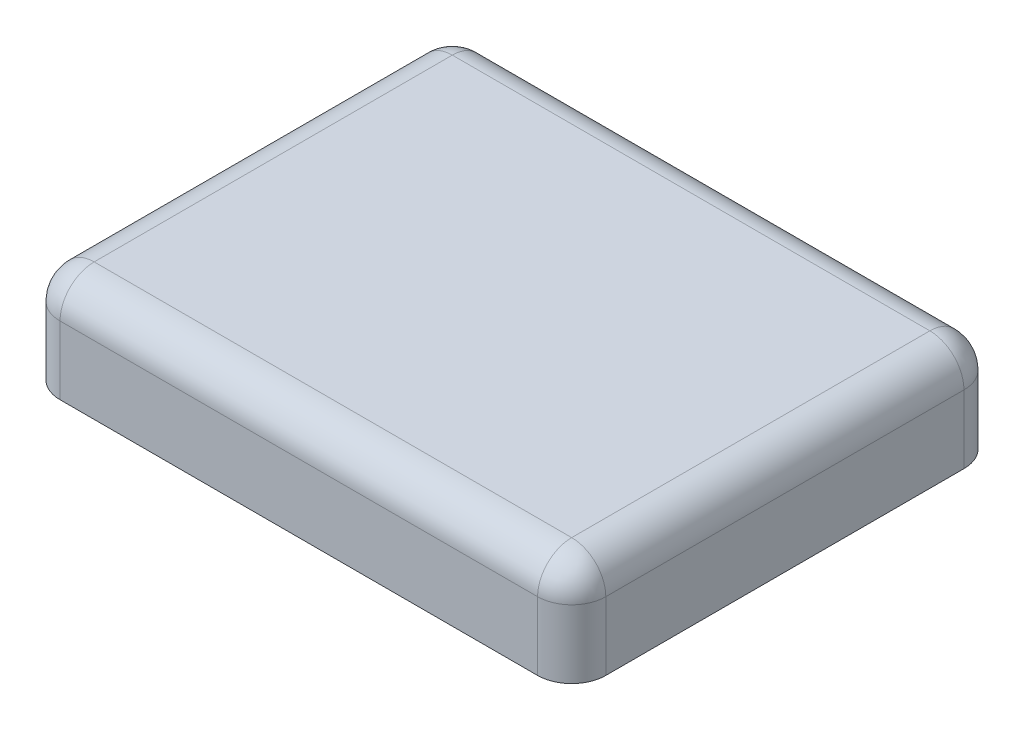
ISO-10303-21;
HEADER;
FILE_DESCRIPTION(('STEP AP214'),'2;1');
FILE_NAME('part.step','',(''),(''),'','','');
FILE_SCHEMA(('AUTOMOTIVE_DESIGN { 1 0 10303 214 1 1 1 1 }'));
ENDSEC;
DATA;
#1=APPLICATION_CONTEXT('core data for automotive mechanical design processes');
#2=APPLICATION_PROTOCOL_DEFINITION('international standard','automotive_design',2000,#1);
#3=PRODUCT_CONTEXT('',#1,'mechanical');
#4=PRODUCT('Part','Part','',(#3));
#5=PRODUCT_RELATED_PRODUCT_CATEGORY('part','',(#4));
#6=PRODUCT_DEFINITION_FORMATION('','',#4);
#7=PRODUCT_DEFINITION_CONTEXT('part definition',#1,'design');
#8=PRODUCT_DEFINITION('design','',#6,#7);
#9=PRODUCT_DEFINITION_SHAPE('','',#8);
#10=(LENGTH_UNIT() NAMED_UNIT(*) SI_UNIT(.MILLI.,.METRE.));
#11=(NAMED_UNIT(*) PLANE_ANGLE_UNIT() SI_UNIT($,.RADIAN.));
#12=(NAMED_UNIT(*) SI_UNIT($,.STERADIAN.) SOLID_ANGLE_UNIT());
#13=UNCERTAINTY_MEASURE_WITH_UNIT(LENGTH_MEASURE(1.E-05),#10,'distance_accuracy_value','');
#14=(GEOMETRIC_REPRESENTATION_CONTEXT(3) GLOBAL_UNCERTAINTY_ASSIGNED_CONTEXT((#13)) GLOBAL_UNIT_ASSIGNED_CONTEXT((#10,
#11,#12)) REPRESENTATION_CONTEXT('',''));
#15=CARTESIAN_POINT('',(0.,0.,0.));
#16=DIRECTION('',(0.,0.,1.));
#17=DIRECTION('',(1.,0.,0.));
#18=AXIS2_PLACEMENT_3D('',#15,#16,#17);
#19=CARTESIAN_POINT('',(1.6,0.6,-1.25));
#20=DIRECTION('',(-1.,0.,0.));
#21=DIRECTION('',(0.,0.,1.));
#22=AXIS2_PLACEMENT_3D('',#19,#20,#21);
#23=PLANE('',#22);
#24=DIRECTION('',(0.,-1.,0.));
#25=VECTOR('',#24,1.);
#26=CARTESIAN_POINT('',(1.6,0.6,-1.05));
#27=LINE('',#26,#25);
#28=CARTESIAN_POINT('',(1.6,0.,-1.05));
#29=VERTEX_POINT('',#28);
#30=CARTESIAN_POINT('',(1.6,0.4,-1.05));
#31=VERTEX_POINT('',#30);
#32=EDGE_CURVE('E121',#29,#31,#27,.F.);
#33=ORIENTED_EDGE('',*,*,#32,.T.);
#34=DIRECTION('',(0.,0.,-1.));
#35=VECTOR('',#34,1.);
#36=CARTESIAN_POINT('',(1.6,0.4,1.05));
#37=LINE('',#36,#35);
#38=CARTESIAN_POINT('',(1.6,0.4,1.05));
#39=VERTEX_POINT('',#38);
#40=EDGE_CURVE('E61',#31,#39,#37,.F.);
#41=ORIENTED_EDGE('',*,*,#40,.T.);
#42=DIRECTION('',(0.,-1.,0.));
#43=VECTOR('',#42,1.);
#44=CARTESIAN_POINT('',(1.6,0.6,1.05));
#45=LINE('',#44,#43);
#46=CARTESIAN_POINT('',(1.6,0.,1.05));
#47=VERTEX_POINT('',#46);
#48=EDGE_CURVE('E114',#39,#47,#45,.T.);
#49=ORIENTED_EDGE('',*,*,#48,.T.);
#50=DIRECTION('',(0.,0.,-1.));
#51=VECTOR('',#50,1.);
#52=CARTESIAN_POINT('',(1.6,0.,-1.25));
#53=LINE('',#52,#51);
#54=EDGE_CURVE('E117',#47,#29,#53,.T.);
#55=ORIENTED_EDGE('',*,*,#54,.T.);
#56=EDGE_LOOP('',(#33,#41,#49,#55));
#57=FACE_BOUND('',#56,.T.);
#58=ADVANCED_FACE('F37',(#57),#23,.F.);
#59=CARTESIAN_POINT('',(-1.6,0.6,-1.25));
#60=DIRECTION('',(0.,0.,1.));
#61=DIRECTION('',(1.,0.,0.));
#62=AXIS2_PLACEMENT_3D('',#59,#60,#61);
#63=PLANE('',#62);
#64=DIRECTION('',(0.,-1.,0.));
#65=VECTOR('',#64,1.);
#66=CARTESIAN_POINT('',(-1.4,0.6,-1.25));
#67=LINE('',#66,#65);
#68=CARTESIAN_POINT('',(-1.4,0.,-1.25));
#69=VERTEX_POINT('',#68);
#70=CARTESIAN_POINT('',(-1.4,0.4,-1.25));
#71=VERTEX_POINT('',#70);
#72=EDGE_CURVE('E154',#69,#71,#67,.F.);
#73=ORIENTED_EDGE('',*,*,#72,.T.);
#74=DIRECTION('',(-1.,0.,0.));
#75=VECTOR('',#74,1.);
#76=CARTESIAN_POINT('',(1.4,0.4,-1.25));
#77=LINE('',#76,#75);
#78=CARTESIAN_POINT('',(1.4,0.4,-1.25));
#79=VERTEX_POINT('',#78);
#80=EDGE_CURVE('E180',#71,#79,#77,.F.);
#81=ORIENTED_EDGE('',*,*,#80,.T.);
#82=DIRECTION('',(0.,-1.,0.));
#83=VECTOR('',#82,1.);
#84=CARTESIAN_POINT('',(1.4,0.6,-1.25));
#85=LINE('',#84,#83);
#86=CARTESIAN_POINT('',(1.4,0.,-1.25));
#87=VERTEX_POINT('',#86);
#88=EDGE_CURVE('E157',#79,#87,#85,.T.);
#89=ORIENTED_EDGE('',*,*,#88,.T.);
#90=DIRECTION('',(-1.,0.,0.));
#91=VECTOR('',#90,1.);
#92=CARTESIAN_POINT('',(-1.6,0.,-1.25));
#93=LINE('',#92,#91);
#94=EDGE_CURVE('E135',#87,#69,#93,.T.);
#95=ORIENTED_EDGE('',*,*,#94,.T.);
#96=EDGE_LOOP('',(#73,#81,#89,#95));
#97=FACE_BOUND('',#96,.T.);
#98=ADVANCED_FACE('F239',(#97),#63,.F.);
#99=CARTESIAN_POINT('',(-1.6,0.6,-1.25));
#100=DIRECTION('',(1.,0.,0.));
#101=DIRECTION('',(0.,0.,-1.));
#102=AXIS2_PLACEMENT_3D('',#99,#100,#101);
#103=PLANE('',#102);
#104=DIRECTION('',(0.,-1.,0.));
#105=VECTOR('',#104,1.);
#106=CARTESIAN_POINT('',(-1.6,0.6,1.05));
#107=LINE('',#106,#105);
#108=CARTESIAN_POINT('',(-1.6,0.,1.05));
#109=VERTEX_POINT('',#108);
#110=CARTESIAN_POINT('',(-1.6,0.4,1.05));
#111=VERTEX_POINT('',#110);
#112=EDGE_CURVE('E161',#109,#111,#107,.F.);
#113=ORIENTED_EDGE('',*,*,#112,.T.);
#114=DIRECTION('',(0.,0.,1.));
#115=VECTOR('',#114,1.);
#116=CARTESIAN_POINT('',(-1.6,0.4,-1.05));
#117=LINE('',#116,#115);
#118=CARTESIAN_POINT('',(-1.6,0.4,-1.05));
#119=VERTEX_POINT('',#118);
#120=EDGE_CURVE('E176',#111,#119,#117,.F.);
#121=ORIENTED_EDGE('',*,*,#120,.T.);
#122=DIRECTION('',(0.,-1.,0.));
#123=VECTOR('',#122,1.);
#124=CARTESIAN_POINT('',(-1.6,0.6,-1.05));
#125=LINE('',#124,#123);
#126=CARTESIAN_POINT('',(-1.6,0.,-1.05));
#127=VERTEX_POINT('',#126);
#128=EDGE_CURVE('E159',#119,#127,#125,.T.);
#129=ORIENTED_EDGE('',*,*,#128,.T.);
#130=DIRECTION('',(0.,0.,1.));
#131=VECTOR('',#130,1.);
#132=CARTESIAN_POINT('',(-1.6,0.,-1.25));
#133=LINE('',#132,#131);
#134=EDGE_CURVE('E138',#127,#109,#133,.T.);
#135=ORIENTED_EDGE('',*,*,#134,.T.);
#136=EDGE_LOOP('',(#113,#121,#129,#135));
#137=FACE_BOUND('',#136,.T.);
#138=ADVANCED_FACE('F244',(#137),#103,.F.);
#139=CARTESIAN_POINT('',(-1.6,0.6,1.25));
#140=DIRECTION('',(0.,0.,-1.));
#141=DIRECTION('',(-1.,0.,0.));
#142=AXIS2_PLACEMENT_3D('',#139,#140,#141);
#143=PLANE('',#142);
#144=DIRECTION('',(0.,-1.,0.));
#145=VECTOR('',#144,1.);
#146=CARTESIAN_POINT('',(1.4,0.6,1.25));
#147=LINE('',#146,#145);
#148=CARTESIAN_POINT('',(1.4,0.,1.25));
#149=VERTEX_POINT('',#148);
#150=CARTESIAN_POINT('',(1.4,0.4,1.25));
#151=VERTEX_POINT('',#150);
#152=EDGE_CURVE('E125',#149,#151,#147,.F.);
#153=ORIENTED_EDGE('',*,*,#152,.T.);
#154=DIRECTION('',(1.,0.,0.));
#155=VECTOR('',#154,1.);
#156=CARTESIAN_POINT('',(-1.4,0.4,1.25));
#157=LINE('',#156,#155);
#158=CARTESIAN_POINT('',(-1.4,0.4,1.25));
#159=VERTEX_POINT('',#158);
#160=EDGE_CURVE('E11',#151,#159,#157,.F.);
#161=ORIENTED_EDGE('',*,*,#160,.T.);
#162=DIRECTION('',(0.,-1.,0.));
#163=VECTOR('',#162,1.);
#164=CARTESIAN_POINT('',(-1.4,0.6,1.25));
#165=LINE('',#164,#163);
#166=CARTESIAN_POINT('',(-1.4,0.,1.25));
#167=VERTEX_POINT('',#166);
#168=EDGE_CURVE('E129',#159,#167,#165,.T.);
#169=ORIENTED_EDGE('',*,*,#168,.T.);
#170=DIRECTION('',(1.,0.,0.));
#171=VECTOR('',#170,1.);
#172=CARTESIAN_POINT('',(-1.6,0.,1.25));
#173=LINE('',#172,#171);
#174=EDGE_CURVE('E145',#167,#149,#173,.T.);
#175=ORIENTED_EDGE('',*,*,#174,.T.);
#176=EDGE_LOOP('',(#153,#161,#169,#175));
#177=FACE_BOUND('',#176,.T.);
#178=ADVANCED_FACE('F355',(#177),#143,.F.);
#179=CARTESIAN_POINT('',(0.,0.6,0.));
#180=DIRECTION('',(0.,1.,0.));
#181=DIRECTION('',(0.,0.,1.));
#182=AXIS2_PLACEMENT_3D('',#179,#180,#181);
#183=PLANE('',#182);
#184=DIRECTION('',(-1.,0.,0.));
#185=VECTOR('',#184,1.);
#186=CARTESIAN_POINT('',(-1.4,0.6,-1.05));
#187=LINE('',#186,#185);
#188=CARTESIAN_POINT('',(1.4,0.6,-1.05));
#189=VERTEX_POINT('',#188);
#190=CARTESIAN_POINT('',(-1.4,0.6,-1.05));
#191=VERTEX_POINT('',#190);
#192=EDGE_CURVE('E171',#189,#191,#187,.T.);
#193=ORIENTED_EDGE('',*,*,#192,.T.);
#194=DIRECTION('',(0.,0.,1.));
#195=VECTOR('',#194,1.);
#196=CARTESIAN_POINT('',(-1.4,0.6,1.05));
#197=LINE('',#196,#195);
#198=CARTESIAN_POINT('',(-1.4,0.6,1.05));
#199=VERTEX_POINT('',#198);
#200=EDGE_CURVE('E173',#191,#199,#197,.T.);
#201=ORIENTED_EDGE('',*,*,#200,.T.);
#202=DIRECTION('',(1.,0.,0.));
#203=VECTOR('',#202,1.);
#204=CARTESIAN_POINT('',(1.4,0.6,1.05));
#205=LINE('',#204,#203);
#206=CARTESIAN_POINT('',(1.4,0.6,1.05));
#207=VERTEX_POINT('',#206);
#208=EDGE_CURVE('E167',#199,#207,#205,.T.);
#209=ORIENTED_EDGE('',*,*,#208,.T.);
#210=DIRECTION('',(0.,0.,-1.));
#211=VECTOR('',#210,1.);
#212=CARTESIAN_POINT('',(1.4,0.6,-1.05));
#213=LINE('',#212,#211);
#214=EDGE_CURVE('E169',#207,#189,#213,.T.);
#215=ORIENTED_EDGE('',*,*,#214,.T.);
#216=EDGE_LOOP('',(#193,#201,#209,#215));
#217=FACE_BOUND('',#216,.T.);
#218=ADVANCED_FACE('F216',(#217),#183,.T.);
#219=CARTESIAN_POINT('',(0.,0.,0.));
#220=DIRECTION('',(0.,1.,0.));
#221=DIRECTION('',(0.,0.,1.));
#222=AXIS2_PLACEMENT_3D('',#219,#220,#221);
#223=PLANE('',#222);
#224=ORIENTED_EDGE('',*,*,#54,.F.);
#225=CARTESIAN_POINT('',(1.4,0.,1.05));
#226=DIRECTION('',(0.,1.,0.));
#227=DIRECTION('',(0.,0.,1.));
#228=AXIS2_PLACEMENT_3D('',#225,#226,#227);
#229=CIRCLE('',#228,0.2);
#230=EDGE_CURVE('E123',#47,#149,#229,.F.);
#231=ORIENTED_EDGE('',*,*,#230,.T.);
#232=ORIENTED_EDGE('',*,*,#174,.F.);
#233=CARTESIAN_POINT('',(-1.4,0.,1.05));
#234=DIRECTION('',(0.,1.,0.));
#235=DIRECTION('',(0.,0.,1.));
#236=AXIS2_PLACEMENT_3D('',#233,#234,#235);
#237=CIRCLE('',#236,0.2);
#238=EDGE_CURVE('E149',#167,#109,#237,.F.);
#239=ORIENTED_EDGE('',*,*,#238,.T.);
#240=ORIENTED_EDGE('',*,*,#134,.F.);
#241=CARTESIAN_POINT('',(-1.4,0.,-1.05));
#242=DIRECTION('',(0.,1.,0.));
#243=DIRECTION('',(0.,0.,1.));
#244=AXIS2_PLACEMENT_3D('',#241,#242,#243);
#245=CIRCLE('',#244,0.2);
#246=EDGE_CURVE('E120',#127,#69,#245,.F.);
#247=ORIENTED_EDGE('',*,*,#246,.T.);
#248=ORIENTED_EDGE('',*,*,#94,.F.);
#249=CARTESIAN_POINT('',(1.4,0.,-1.05));
#250=DIRECTION('',(0.,1.,0.));
#251=DIRECTION('',(0.,0.,1.));
#252=AXIS2_PLACEMENT_3D('',#249,#250,#251);
#253=CIRCLE('',#252,0.2);
#254=EDGE_CURVE('E130',#87,#29,#253,.F.);
#255=ORIENTED_EDGE('',*,*,#254,.T.);
#256=EDGE_LOOP('',(#224,#231,#232,#239,#240,#247,#248,#255));
#257=FACE_BOUND('',#256,.T.);
#258=ADVANCED_FACE('F132',(#257),#223,.F.);
#259=CARTESIAN_POINT('',(1.4,0.6,1.05));
#260=DIRECTION('',(0.,-1.,0.));
#261=DIRECTION('',(0.,0.,-1.));
#262=AXIS2_PLACEMENT_3D('',#259,#260,#261);
#263=CYLINDRICAL_SURFACE('',#262,0.2);
#264=ORIENTED_EDGE('',*,*,#48,.F.);
#265=CARTESIAN_POINT('',(1.4,0.4,1.05));
#266=DIRECTION('',(0.,-1.,0.));
#267=DIRECTION('',(0.,0.,-1.));
#268=AXIS2_PLACEMENT_3D('',#265,#266,#267);
#269=CIRCLE('',#268,0.2);
#270=EDGE_CURVE('E46',#39,#151,#269,.T.);
#271=ORIENTED_EDGE('',*,*,#270,.T.);
#272=ORIENTED_EDGE('',*,*,#152,.F.);
#273=ORIENTED_EDGE('',*,*,#230,.F.);
#274=EDGE_LOOP('',(#264,#271,#272,#273));
#275=FACE_BOUND('',#274,.T.);
#276=ADVANCED_FACE('F124',(#275),#263,.T.);
#277=CARTESIAN_POINT('',(1.4,0.6,-1.05));
#278=DIRECTION('',(0.,-1.,0.));
#279=DIRECTION('',(0.,0.,-1.));
#280=AXIS2_PLACEMENT_3D('',#277,#278,#279);
#281=CYLINDRICAL_SURFACE('',#280,0.2);
#282=ORIENTED_EDGE('',*,*,#88,.F.);
#283=CARTESIAN_POINT('',(1.4,0.4,-1.05));
#284=DIRECTION('',(0.,-1.,0.));
#285=DIRECTION('',(0.,0.,-1.));
#286=AXIS2_PLACEMENT_3D('',#283,#284,#285);
#287=CIRCLE('',#286,0.2);
#288=EDGE_CURVE('E182',#79,#31,#287,.T.);
#289=ORIENTED_EDGE('',*,*,#288,.T.);
#290=ORIENTED_EDGE('',*,*,#32,.F.);
#291=ORIENTED_EDGE('',*,*,#254,.F.);
#292=EDGE_LOOP('',(#282,#289,#290,#291));
#293=FACE_BOUND('',#292,.T.);
#294=ADVANCED_FACE('F251',(#293),#281,.T.);
#295=CARTESIAN_POINT('',(-1.4,0.6,1.05));
#296=DIRECTION('',(0.,-1.,0.));
#297=DIRECTION('',(0.,0.,-1.));
#298=AXIS2_PLACEMENT_3D('',#295,#296,#297);
#299=CYLINDRICAL_SURFACE('',#298,0.2);
#300=ORIENTED_EDGE('',*,*,#168,.F.);
#301=CARTESIAN_POINT('',(-1.4,0.4,1.05));
#302=DIRECTION('',(0.,-1.,0.));
#303=DIRECTION('',(0.,0.,-1.));
#304=AXIS2_PLACEMENT_3D('',#301,#302,#303);
#305=CIRCLE('',#304,0.2);
#306=EDGE_CURVE('E164',#159,#111,#305,.T.);
#307=ORIENTED_EDGE('',*,*,#306,.T.);
#308=ORIENTED_EDGE('',*,*,#112,.F.);
#309=ORIENTED_EDGE('',*,*,#238,.F.);
#310=EDGE_LOOP('',(#300,#307,#308,#309));
#311=FACE_BOUND('',#310,.T.);
#312=ADVANCED_FACE('F254',(#311),#299,.T.);
#313=CARTESIAN_POINT('',(-1.4,0.6,-1.05));
#314=DIRECTION('',(0.,-1.,0.));
#315=DIRECTION('',(0.,0.,-1.));
#316=AXIS2_PLACEMENT_3D('',#313,#314,#315);
#317=CYLINDRICAL_SURFACE('',#316,0.2);
#318=ORIENTED_EDGE('',*,*,#128,.F.);
#319=CARTESIAN_POINT('',(-1.4,0.4,-1.05));
#320=DIRECTION('',(0.,-1.,0.));
#321=DIRECTION('',(0.,0.,-1.));
#322=AXIS2_PLACEMENT_3D('',#319,#320,#321);
#323=CIRCLE('',#322,0.2);
#324=EDGE_CURVE('E178',#119,#71,#323,.T.);
#325=ORIENTED_EDGE('',*,*,#324,.T.);
#326=ORIENTED_EDGE('',*,*,#72,.F.);
#327=ORIENTED_EDGE('',*,*,#246,.F.);
#328=EDGE_LOOP('',(#318,#325,#326,#327));
#329=FACE_BOUND('',#328,.T.);
#330=ADVANCED_FACE('F258',(#329),#317,.T.);
#331=CARTESIAN_POINT('',(1.4,0.4,-1.05));
#332=DIRECTION('',(0.,1.,0.));
#333=DIRECTION('',(0.,0.,1.));
#334=AXIS2_PLACEMENT_3D('',#331,#332,#333);
#335=SPHERICAL_SURFACE('',#334,0.2);
#336=CARTESIAN_POINT('',(1.4,0.4,-1.05));
#337=DIRECTION('',(0.,0.,1.));
#338=DIRECTION('',(1.,0.,0.));
#339=AXIS2_PLACEMENT_3D('',#336,#337,#338);
#340=CIRCLE('',#339,0.2);
#341=EDGE_CURVE('E141',#31,#189,#340,.T.);
#342=ORIENTED_EDGE('',*,*,#341,.F.);
#343=ORIENTED_EDGE('',*,*,#288,.F.);
#344=CARTESIAN_POINT('',(1.4,0.4,-1.05));
#345=DIRECTION('',(-1.,0.,0.));
#346=DIRECTION('',(0.,0.,1.));
#347=AXIS2_PLACEMENT_3D('',#344,#345,#346);
#348=CIRCLE('',#347,0.2);
#349=EDGE_CURVE('E41',#189,#79,#348,.T.);
#350=ORIENTED_EDGE('',*,*,#349,.F.);
#351=EDGE_LOOP('',(#342,#343,#350));
#352=FACE_BOUND('',#351,.T.);
#353=ADVANCED_FACE('F39',(#352),#335,.T.);
#354=CARTESIAN_POINT('',(0.,0.4,-1.05));
#355=DIRECTION('',(1.,0.,0.));
#356=DIRECTION('',(0.,0.,-1.));
#357=AXIS2_PLACEMENT_3D('',#354,#355,#356);
#358=CYLINDRICAL_SURFACE('',#357,0.2);
#359=ORIENTED_EDGE('',*,*,#349,.T.);
#360=ORIENTED_EDGE('',*,*,#80,.F.);
#361=CARTESIAN_POINT('',(-1.4,0.4,-1.05));
#362=DIRECTION('',(-1.,0.,0.));
#363=DIRECTION('',(0.,0.,1.));
#364=AXIS2_PLACEMENT_3D('',#361,#362,#363);
#365=CIRCLE('',#364,0.2);
#366=EDGE_CURVE('E199',#191,#71,#365,.T.);
#367=ORIENTED_EDGE('',*,*,#366,.F.);
#368=ORIENTED_EDGE('',*,*,#192,.F.);
#369=EDGE_LOOP('',(#359,#360,#367,#368));
#370=FACE_BOUND('',#369,.T.);
#371=ADVANCED_FACE('F213',(#370),#358,.T.);
#372=CARTESIAN_POINT('',(1.4,0.4,0.));
#373=DIRECTION('',(0.,0.,1.));
#374=DIRECTION('',(1.,0.,0.));
#375=AXIS2_PLACEMENT_3D('',#372,#373,#374);
#376=CYLINDRICAL_SURFACE('',#375,0.2);
#377=ORIENTED_EDGE('',*,*,#341,.T.);
#378=ORIENTED_EDGE('',*,*,#214,.F.);
#379=CARTESIAN_POINT('',(1.4,0.4,1.05));
#380=DIRECTION('',(0.,0.,1.));
#381=DIRECTION('',(1.,0.,0.));
#382=AXIS2_PLACEMENT_3D('',#379,#380,#381);
#383=CIRCLE('',#382,0.2);
#384=EDGE_CURVE('E196',#39,#207,#383,.T.);
#385=ORIENTED_EDGE('',*,*,#384,.F.);
#386=ORIENTED_EDGE('',*,*,#40,.F.);
#387=EDGE_LOOP('',(#377,#378,#385,#386));
#388=FACE_BOUND('',#387,.T.);
#389=ADVANCED_FACE('F206',(#388),#376,.T.);
#390=CARTESIAN_POINT('',(-1.4,0.4,-1.05));
#391=DIRECTION('',(0.,1.,0.));
#392=DIRECTION('',(0.,0.,1.));
#393=AXIS2_PLACEMENT_3D('',#390,#391,#392);
#394=SPHERICAL_SURFACE('',#393,0.2);
#395=ORIENTED_EDGE('',*,*,#366,.T.);
#396=ORIENTED_EDGE('',*,*,#324,.F.);
#397=CARTESIAN_POINT('',(-1.4,0.4,-1.05));
#398=DIRECTION('',(0.,0.,1.));
#399=DIRECTION('',(1.,0.,0.));
#400=AXIS2_PLACEMENT_3D('',#397,#398,#399);
#401=CIRCLE('',#400,0.2);
#402=EDGE_CURVE('E193',#191,#119,#401,.T.);
#403=ORIENTED_EDGE('',*,*,#402,.F.);
#404=EDGE_LOOP('',(#395,#396,#403));
#405=FACE_BOUND('',#404,.T.);
#406=ADVANCED_FACE('F228',(#405),#394,.T.);
#407=CARTESIAN_POINT('',(1.4,0.4,1.05));
#408=DIRECTION('',(0.,1.,0.));
#409=DIRECTION('',(0.,0.,1.));
#410=AXIS2_PLACEMENT_3D('',#407,#408,#409);
#411=SPHERICAL_SURFACE('',#410,0.2);
#412=ORIENTED_EDGE('',*,*,#270,.F.);
#413=ORIENTED_EDGE('',*,*,#384,.T.);
#414=CARTESIAN_POINT('',(1.4,0.4,1.05));
#415=DIRECTION('',(-1.,0.,0.));
#416=DIRECTION('',(0.,0.,1.));
#417=AXIS2_PLACEMENT_3D('',#414,#415,#416);
#418=CIRCLE('',#417,0.2);
#419=EDGE_CURVE('E190',#151,#207,#418,.T.);
#420=ORIENTED_EDGE('',*,*,#419,.F.);
#421=EDGE_LOOP('',(#412,#413,#420));
#422=FACE_BOUND('',#421,.T.);
#423=ADVANCED_FACE('F225',(#422),#411,.T.);
#424=CARTESIAN_POINT('',(-1.4,0.4,0.));
#425=DIRECTION('',(0.,0.,-1.));
#426=DIRECTION('',(-1.,0.,0.));
#427=AXIS2_PLACEMENT_3D('',#424,#425,#426);
#428=CYLINDRICAL_SURFACE('',#427,0.2);
#429=ORIENTED_EDGE('',*,*,#402,.T.);
#430=ORIENTED_EDGE('',*,*,#120,.F.);
#431=CARTESIAN_POINT('',(-1.4,0.4,1.05));
#432=DIRECTION('',(0.,0.,1.));
#433=DIRECTION('',(1.,0.,0.));
#434=AXIS2_PLACEMENT_3D('',#431,#432,#433);
#435=CIRCLE('',#434,0.2);
#436=EDGE_CURVE('E188',#199,#111,#435,.T.);
#437=ORIENTED_EDGE('',*,*,#436,.F.);
#438=ORIENTED_EDGE('',*,*,#200,.F.);
#439=EDGE_LOOP('',(#429,#430,#437,#438));
#440=FACE_BOUND('',#439,.T.);
#441=ADVANCED_FACE('F227',(#440),#428,.T.);
#442=CARTESIAN_POINT('',(0.,0.4,1.05));
#443=DIRECTION('',(-1.,0.,0.));
#444=DIRECTION('',(0.,0.,1.));
#445=AXIS2_PLACEMENT_3D('',#442,#443,#444);
#446=CYLINDRICAL_SURFACE('',#445,0.2);
#447=ORIENTED_EDGE('',*,*,#419,.T.);
#448=ORIENTED_EDGE('',*,*,#208,.F.);
#449=CARTESIAN_POINT('',(-1.4,0.4,1.05));
#450=DIRECTION('',(-1.,0.,0.));
#451=DIRECTION('',(0.,0.,1.));
#452=AXIS2_PLACEMENT_3D('',#449,#450,#451);
#453=CIRCLE('',#452,0.2);
#454=EDGE_CURVE('E186',#159,#199,#453,.T.);
#455=ORIENTED_EDGE('',*,*,#454,.F.);
#456=ORIENTED_EDGE('',*,*,#160,.F.);
#457=EDGE_LOOP('',(#447,#448,#455,#456));
#458=FACE_BOUND('',#457,.T.);
#459=ADVANCED_FACE('F221',(#458),#446,.T.);
#460=CARTESIAN_POINT('',(-1.4,0.4,1.05));
#461=DIRECTION('',(0.,1.,0.));
#462=DIRECTION('',(0.,0.,1.));
#463=AXIS2_PLACEMENT_3D('',#460,#461,#462);
#464=SPHERICAL_SURFACE('',#463,0.2);
#465=ORIENTED_EDGE('',*,*,#436,.T.);
#466=ORIENTED_EDGE('',*,*,#306,.F.);
#467=ORIENTED_EDGE('',*,*,#454,.T.);
#468=EDGE_LOOP('',(#465,#466,#467));
#469=FACE_BOUND('',#468,.T.);
#470=ADVANCED_FACE('F263',(#469),#464,.T.);
#471=CLOSED_SHELL('',(#58,#98,#138,#178,#218,#258,#276,#294,#312,#330,#353,#371,#389,#406,#423,
#441,#459,#470));
#472=MANIFOLD_SOLID_BREP('B2',#471);
#473=ADVANCED_BREP_SHAPE_REPRESENTATION('',(#18,#472),#14);
#474=SHAPE_DEFINITION_REPRESENTATION(#9,#473);
ENDSEC;
END-ISO-10303-21;
